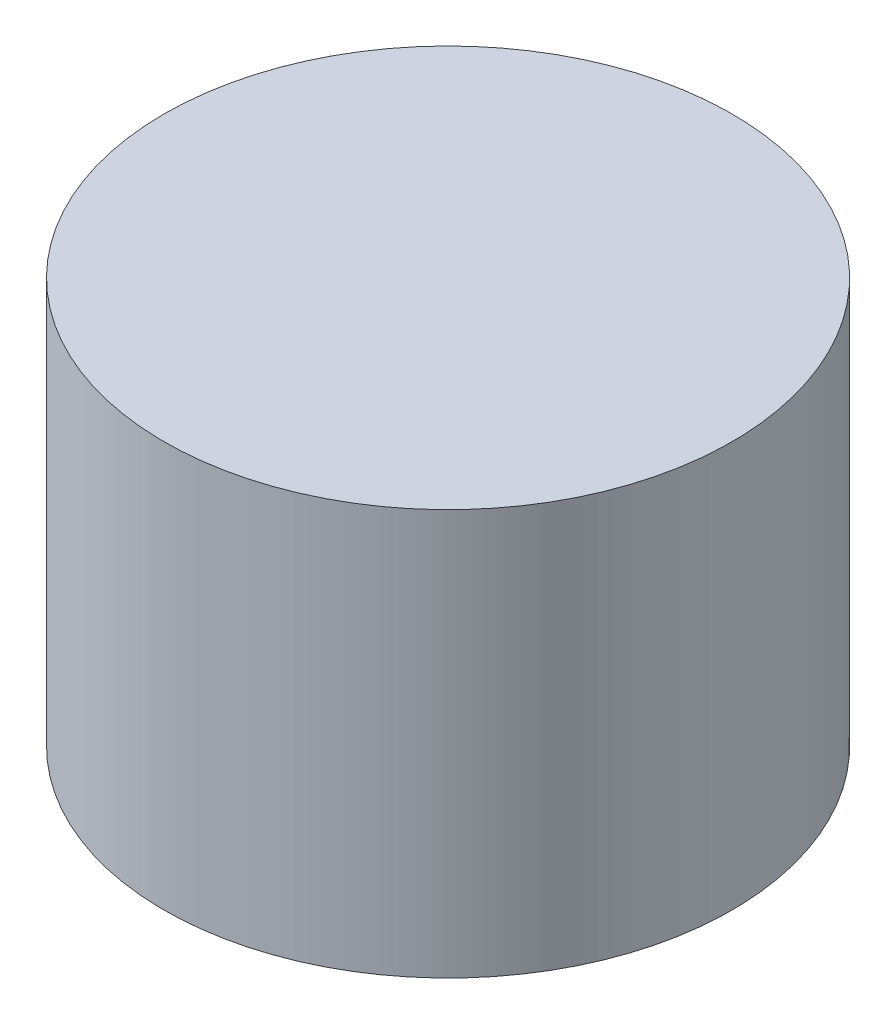
ISO-10303-21;
HEADER;
FILE_DESCRIPTION(('STEP AP214'),'2;1');
FILE_NAME('part.step','',(''),(''),'','','');
FILE_SCHEMA(('AUTOMOTIVE_DESIGN { 1 0 10303 214 1 1 1 1 }'));
ENDSEC;
DATA;
#1=APPLICATION_CONTEXT('core data for automotive mechanical design processes');
#2=APPLICATION_PROTOCOL_DEFINITION('international standard','automotive_design',2000,#1);
#3=PRODUCT_CONTEXT('',#1,'mechanical');
#4=PRODUCT('Part','Part','',(#3));
#5=PRODUCT_RELATED_PRODUCT_CATEGORY('part','',(#4));
#6=PRODUCT_DEFINITION_FORMATION('','',#4);
#7=PRODUCT_DEFINITION_CONTEXT('part definition',#1,'design');
#8=PRODUCT_DEFINITION('design','',#6,#7);
#9=PRODUCT_DEFINITION_SHAPE('','',#8);
#10=(LENGTH_UNIT() NAMED_UNIT(*) SI_UNIT(.MILLI.,.METRE.));
#11=(NAMED_UNIT(*) PLANE_ANGLE_UNIT() SI_UNIT($,.RADIAN.));
#12=(NAMED_UNIT(*) SI_UNIT($,.STERADIAN.) SOLID_ANGLE_UNIT());
#13=UNCERTAINTY_MEASURE_WITH_UNIT(LENGTH_MEASURE(1.E-05),#10,'distance_accuracy_value','');
#14=(GEOMETRIC_REPRESENTATION_CONTEXT(3) GLOBAL_UNCERTAINTY_ASSIGNED_CONTEXT((#13)) GLOBAL_UNIT_ASSIGNED_CONTEXT((#10,
#11,#12)) REPRESENTATION_CONTEXT('',''));
#15=CARTESIAN_POINT('',(0.,0.,0.));
#16=DIRECTION('',(0.,0.,1.));
#17=DIRECTION('',(1.,0.,0.));
#18=AXIS2_PLACEMENT_3D('',#15,#16,#17);
#19=CARTESIAN_POINT('',(-657.034212682664,0.,-116.570586121118));
#20=DIRECTION('',(0.,1.,0.));
#21=DIRECTION('',(1.,0.,0.));
#22=AXIS2_PLACEMENT_3D('',#19,#20,#21);
#23=PLANE('',#22);
#24=CARTESIAN_POINT('',(-657.034212682664,0.,-116.570586121118));
#25=DIRECTION('',(0.,1.,0.));
#26=DIRECTION('',(1.,0.,0.));
#27=AXIS2_PLACEMENT_3D('',#24,#25,#26);
#28=CIRCLE('',#27,14.);
#29=CARTESIAN_POINT('',(-671.034212682664,0.,-116.570586121118));
#30=VERTEX_POINT('',#29);
#31=EDGE_CURVE('E11',#30,#30,#28,.T.);
#32=ORIENTED_EDGE('',*,*,#31,.F.);
#33=EDGE_LOOP('',(#32));
#34=FACE_BOUND('',#33,.T.);
#35=ADVANCED_FACE('F17',(#34),#23,.F.);
#36=CARTESIAN_POINT('',(-657.034212682664,20.,-116.570586121118));
#37=DIRECTION('',(0.,1.,0.));
#38=DIRECTION('',(1.,0.,0.));
#39=AXIS2_PLACEMENT_3D('',#36,#37,#38);
#40=PLANE('',#39);
#41=CARTESIAN_POINT('',(-657.034212682664,20.,-116.570586121118));
#42=DIRECTION('',(0.,1.,0.));
#43=DIRECTION('',(1.,0.,0.));
#44=AXIS2_PLACEMENT_3D('',#41,#42,#43);
#45=CIRCLE('',#44,14.);
#46=CARTESIAN_POINT('',(-671.034212682664,20.,-116.570586121118));
#47=VERTEX_POINT('',#46);
#48=EDGE_CURVE('E42',#47,#47,#45,.T.);
#49=ORIENTED_EDGE('',*,*,#48,.T.);
#50=EDGE_LOOP('',(#49));
#51=FACE_BOUND('',#50,.T.);
#52=ADVANCED_FACE('F45',(#51),#40,.T.);
#53=CARTESIAN_POINT('',(-657.034212682664,0.,-116.570586121118));
#54=DIRECTION('',(0.,1.,0.));
#55=DIRECTION('',(1.,0.,0.));
#56=AXIS2_PLACEMENT_3D('',#53,#54,#55);
#57=CYLINDRICAL_SURFACE('',#56,14.);
#58=ORIENTED_EDGE('',*,*,#48,.F.);
#59=DIRECTION('',(0.,-1.,0.));
#60=VECTOR('',#59,1.);
#61=CARTESIAN_POINT('',(-671.034212682664,0.,-116.570586121118));
#62=LINE('',#61,#60);
#63=EDGE_CURVE('E20',#47,#30,#62,.T.);
#64=ORIENTED_EDGE('',*,*,#63,.T.);
#65=ORIENTED_EDGE('',*,*,#31,.T.);
#66=ORIENTED_EDGE('',*,*,#63,.F.);
#67=EDGE_LOOP('',(#58,#64,#65,#66));
#68=FACE_BOUND('',#67,.T.);
#69=ADVANCED_FACE('F41',(#68),#57,.T.);
#70=CLOSED_SHELL('',(#35,#52,#69));
#71=MANIFOLD_SOLID_BREP('B1',#70);
#72=ADVANCED_BREP_SHAPE_REPRESENTATION('',(#18,#71),#14);
#73=SHAPE_DEFINITION_REPRESENTATION(#9,#72);
ENDSEC;
END-ISO-10303-21;
